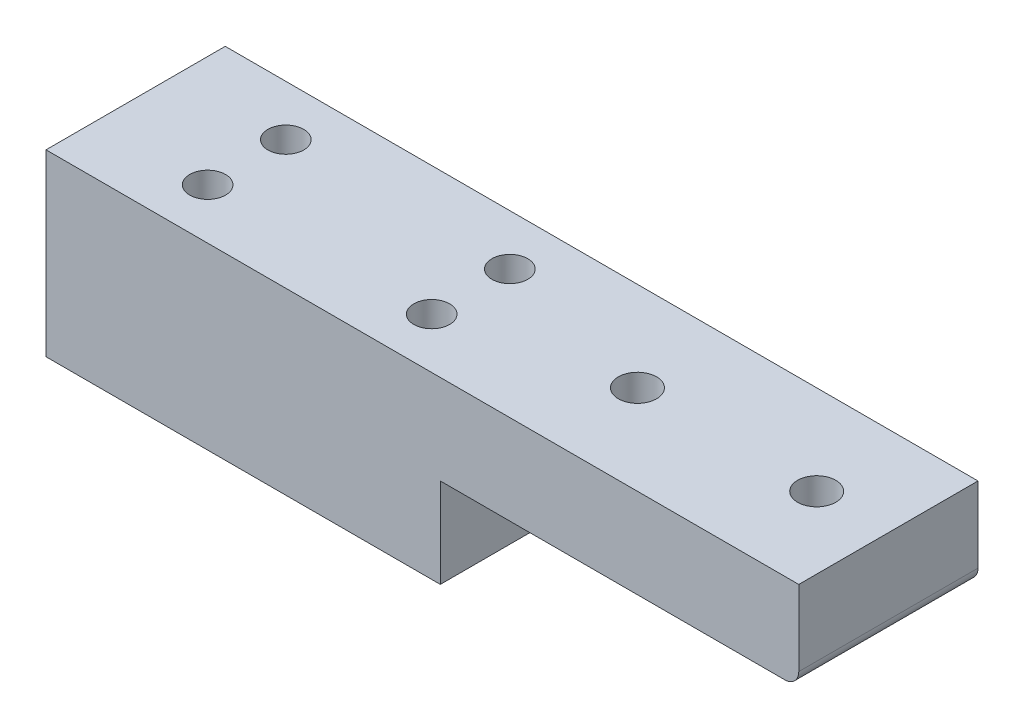
ISO-10303-21;
HEADER;
FILE_DESCRIPTION(('STEP AP214'),'2;1');
FILE_NAME('part.step','',(''),(''),'','','');
FILE_SCHEMA(('AUTOMOTIVE_DESIGN { 1 0 10303 214 1 1 1 1 }'));
ENDSEC;
DATA;
#1=APPLICATION_CONTEXT('core data for automotive mechanical design processes');
#2=APPLICATION_PROTOCOL_DEFINITION('international standard','automotive_design',2000,#1);
#3=PRODUCT_CONTEXT('',#1,'mechanical');
#4=PRODUCT('Part','Part','',(#3));
#5=PRODUCT_RELATED_PRODUCT_CATEGORY('part','',(#4));
#6=PRODUCT_DEFINITION_FORMATION('','',#4);
#7=PRODUCT_DEFINITION_CONTEXT('part definition',#1,'design');
#8=PRODUCT_DEFINITION('design','',#6,#7);
#9=PRODUCT_DEFINITION_SHAPE('','',#8);
#10=(LENGTH_UNIT() NAMED_UNIT(*) SI_UNIT(.MILLI.,.METRE.));
#11=(NAMED_UNIT(*) PLANE_ANGLE_UNIT() SI_UNIT($,.RADIAN.));
#12=(NAMED_UNIT(*) SI_UNIT($,.STERADIAN.) SOLID_ANGLE_UNIT());
#13=UNCERTAINTY_MEASURE_WITH_UNIT(LENGTH_MEASURE(1.E-05),#10,'distance_accuracy_value','');
#14=(GEOMETRIC_REPRESENTATION_CONTEXT(3) GLOBAL_UNCERTAINTY_ASSIGNED_CONTEXT((#13)) GLOBAL_UNIT_ASSIGNED_CONTEXT((#10,
#11,#12)) REPRESENTATION_CONTEXT('',''));
#15=CARTESIAN_POINT('',(0.,0.,0.));
#16=DIRECTION('',(0.,0.,1.));
#17=DIRECTION('',(1.,0.,0.));
#18=AXIS2_PLACEMENT_3D('',#15,#16,#17);
#19=CARTESIAN_POINT('',(0.,6.35,12.7));
#20=DIRECTION('',(0.,0.,-1.));
#21=DIRECTION('',(-1.,0.,0.));
#22=AXIS2_PLACEMENT_3D('',#19,#20,#21);
#23=PLANE('',#22);
#24=DIRECTION('',(1.,0.,0.));
#25=VECTOR('',#24,1.);
#26=CARTESIAN_POINT('',(0.,6.35,12.7));
#27=LINE('',#26,#25);
#28=CARTESIAN_POINT('',(25.4,6.35,12.7));
#29=VERTEX_POINT('',#28);
#30=CARTESIAN_POINT('',(49.8,6.35,12.7));
#31=VERTEX_POINT('',#30);
#32=EDGE_CURVE('E159',#29,#31,#27,.T.);
#33=ORIENTED_EDGE('',*,*,#32,.T.);
#34=CARTESIAN_POINT('',(49.8,7.35,12.7));
#35=DIRECTION('',(0.,0.,-1.));
#36=DIRECTION('',(-1.,0.,0.));
#37=AXIS2_PLACEMENT_3D('',#34,#35,#36);
#38=CIRCLE('',#37,1.);
#39=CARTESIAN_POINT('',(50.8,7.35,12.7));
#40=VERTEX_POINT('',#39);
#41=EDGE_CURVE('E11',#31,#40,#38,.F.);
#42=ORIENTED_EDGE('',*,*,#41,.T.);
#43=DIRECTION('',(0.,-1.,0.));
#44=VECTOR('',#43,1.);
#45=CARTESIAN_POINT('',(50.8,12.7,12.7));
#46=LINE('',#45,#44);
#47=CARTESIAN_POINT('',(50.8,12.7,12.7));
#48=VERTEX_POINT('',#47);
#49=EDGE_CURVE('E171',#48,#40,#46,.T.);
#50=ORIENTED_EDGE('',*,*,#49,.F.);
#51=DIRECTION('',(1.,0.,0.));
#52=VECTOR('',#51,1.);
#53=CARTESIAN_POINT('',(0.,12.7,12.7));
#54=LINE('',#53,#52);
#55=CARTESIAN_POINT('',(-2.54,12.7,12.7));
#56=VERTEX_POINT('',#55);
#57=EDGE_CURVE('E160',#56,#48,#54,.T.);
#58=ORIENTED_EDGE('',*,*,#57,.F.);
#59=DIRECTION('',(0.,1.,0.));
#60=VECTOR('',#59,1.);
#61=CARTESIAN_POINT('',(-2.54,12.7,12.7));
#62=LINE('',#61,#60);
#63=CARTESIAN_POINT('',(-2.54,0.,12.7));
#64=VERTEX_POINT('',#63);
#65=EDGE_CURVE('E106',#64,#56,#62,.T.);
#66=ORIENTED_EDGE('',*,*,#65,.F.);
#67=DIRECTION('',(1.,0.,0.));
#68=VECTOR('',#67,1.);
#69=CARTESIAN_POINT('',(0.,0.,12.7));
#70=LINE('',#69,#68);
#71=CARTESIAN_POINT('',(25.4,0.,12.7));
#72=VERTEX_POINT('',#71);
#73=EDGE_CURVE('E174',#64,#72,#70,.T.);
#74=ORIENTED_EDGE('',*,*,#73,.T.);
#75=DIRECTION('',(0.,-1.,0.));
#76=VECTOR('',#75,1.);
#77=CARTESIAN_POINT('',(25.4,6.35,12.7));
#78=LINE('',#77,#76);
#79=EDGE_CURVE('E186',#29,#72,#78,.T.);
#80=ORIENTED_EDGE('',*,*,#79,.F.);
#81=EDGE_LOOP('',(#33,#42,#50,#58,#66,#74,#80));
#82=FACE_BOUND('',#81,.T.);
#83=ADVANCED_FACE('F37',(#82),#23,.F.);
#84=CARTESIAN_POINT('',(25.4,6.35,0.));
#85=DIRECTION('',(-1.,0.,0.));
#86=DIRECTION('',(0.,0.,1.));
#87=AXIS2_PLACEMENT_3D('',#84,#85,#86);
#88=PLANE('',#87);
#89=DIRECTION('',(0.,0.,-1.));
#90=VECTOR('',#89,1.);
#91=CARTESIAN_POINT('',(25.4,0.,0.));
#92=LINE('',#91,#90);
#93=CARTESIAN_POINT('',(25.4,0.,0.));
#94=VERTEX_POINT('',#93);
#95=EDGE_CURVE('E181',#72,#94,#92,.T.);
#96=ORIENTED_EDGE('',*,*,#95,.T.);
#97=DIRECTION('',(0.,-1.,0.));
#98=VECTOR('',#97,1.);
#99=CARTESIAN_POINT('',(25.4,6.35,0.));
#100=LINE('',#99,#98);
#101=CARTESIAN_POINT('',(25.4,6.35,0.));
#102=VERTEX_POINT('',#101);
#103=EDGE_CURVE('E178',#102,#94,#100,.T.);
#104=ORIENTED_EDGE('',*,*,#103,.F.);
#105=DIRECTION('',(0.,0.,-1.));
#106=VECTOR('',#105,1.);
#107=CARTESIAN_POINT('',(25.4,6.35,0.));
#108=LINE('',#107,#106);
#109=EDGE_CURVE('E175',#29,#102,#108,.T.);
#110=ORIENTED_EDGE('',*,*,#109,.F.);
#111=ORIENTED_EDGE('',*,*,#79,.T.);
#112=EDGE_LOOP('',(#96,#104,#110,#111));
#113=FACE_BOUND('',#112,.T.);
#114=ADVANCED_FACE('F222',(#113),#88,.F.);
#115=CARTESIAN_POINT('',(0.,6.35,0.));
#116=DIRECTION('',(0.,0.,1.));
#117=DIRECTION('',(1.,0.,0.));
#118=AXIS2_PLACEMENT_3D('',#115,#116,#117);
#119=PLANE('',#118);
#120=DIRECTION('',(0.,-1.,0.));
#121=VECTOR('',#120,1.);
#122=CARTESIAN_POINT('',(50.8,12.7,0.));
#123=LINE('',#122,#121);
#124=CARTESIAN_POINT('',(50.8,12.7,0.));
#125=VERTEX_POINT('',#124);
#126=CARTESIAN_POINT('',(50.8,7.35,0.));
#127=VERTEX_POINT('',#126);
#128=EDGE_CURVE('E167',#125,#127,#123,.T.);
#129=ORIENTED_EDGE('',*,*,#128,.T.);
#130=CARTESIAN_POINT('',(49.8,7.35,0.));
#131=DIRECTION('',(0.,0.,1.));
#132=DIRECTION('',(1.,0.,0.));
#133=AXIS2_PLACEMENT_3D('',#130,#131,#132);
#134=CIRCLE('',#133,1.);
#135=CARTESIAN_POINT('',(49.8,6.35,0.));
#136=VERTEX_POINT('',#135);
#137=EDGE_CURVE('E59',#127,#136,#134,.F.);
#138=ORIENTED_EDGE('',*,*,#137,.T.);
#139=DIRECTION('',(-1.,0.,0.));
#140=VECTOR('',#139,1.);
#141=CARTESIAN_POINT('',(0.,6.35,0.));
#142=LINE('',#141,#140);
#143=EDGE_CURVE('E163',#136,#102,#142,.T.);
#144=ORIENTED_EDGE('',*,*,#143,.T.);
#145=ORIENTED_EDGE('',*,*,#103,.T.);
#146=DIRECTION('',(-1.,0.,0.));
#147=VECTOR('',#146,1.);
#148=CARTESIAN_POINT('',(0.,0.,0.));
#149=LINE('',#148,#147);
#150=CARTESIAN_POINT('',(-2.54,0.,0.));
#151=VERTEX_POINT('',#150);
#152=EDGE_CURVE('E179',#94,#151,#149,.T.);
#153=ORIENTED_EDGE('',*,*,#152,.T.);
#154=DIRECTION('',(0.,-1.,0.));
#155=VECTOR('',#154,1.);
#156=CARTESIAN_POINT('',(-2.54,12.7,0.));
#157=LINE('',#156,#155);
#158=CARTESIAN_POINT('',(-2.54,12.7,0.));
#159=VERTEX_POINT('',#158);
#160=EDGE_CURVE('E117',#159,#151,#157,.T.);
#161=ORIENTED_EDGE('',*,*,#160,.F.);
#162=DIRECTION('',(-1.,0.,0.));
#163=VECTOR('',#162,1.);
#164=CARTESIAN_POINT('',(0.,12.7,0.));
#165=LINE('',#164,#163);
#166=EDGE_CURVE('E165',#125,#159,#165,.T.);
#167=ORIENTED_EDGE('',*,*,#166,.F.);
#168=EDGE_LOOP('',(#129,#138,#144,#145,#153,#161,#167));
#169=FACE_BOUND('',#168,.T.);
#170=ADVANCED_FACE('F201',(#169),#119,.F.);
#171=CARTESIAN_POINT('',(0.,0.,0.));
#172=DIRECTION('',(0.,1.,0.));
#173=DIRECTION('',(0.,0.,1.));
#174=AXIS2_PLACEMENT_3D('',#171,#172,#173);
#175=PLANE('',#174);
#176=CARTESIAN_POINT('',(5.334,0.,3.5814));
#177=DIRECTION('',(0.,-1.,0.));
#178=DIRECTION('',(0.,0.,-1.));
#179=AXIS2_PLACEMENT_3D('',#176,#177,#178);
#180=CIRCLE('',#179,1.26999999999999);
#181=CARTESIAN_POINT('',(5.334,0.,2.31140000000001));
#182=VERTEX_POINT('',#181);
#183=EDGE_CURVE('E135',#182,#182,#180,.T.);
#184=ORIENTED_EDGE('',*,*,#183,.F.);
#185=EDGE_LOOP('',(#184));
#186=FACE_BOUND('',#185,.T.);
#187=CARTESIAN_POINT('',(21.209,0.,3.5814));
#188=DIRECTION('',(0.,-1.,0.));
#189=DIRECTION('',(0.,0.,-1.));
#190=AXIS2_PLACEMENT_3D('',#187,#188,#189);
#191=CIRCLE('',#190,1.26999999999999);
#192=CARTESIAN_POINT('',(21.209,0.,2.31140000000001));
#193=VERTEX_POINT('',#192);
#194=EDGE_CURVE('E141',#193,#193,#191,.T.);
#195=ORIENTED_EDGE('',*,*,#194,.F.);
#196=EDGE_LOOP('',(#195));
#197=FACE_BOUND('',#196,.T.);
#198=CARTESIAN_POINT('',(21.209,0.,9.1186));
#199=DIRECTION('',(0.,-1.,0.));
#200=DIRECTION('',(0.,0.,-1.));
#201=AXIS2_PLACEMENT_3D('',#198,#199,#200);
#202=CIRCLE('',#201,1.26999999999999);
#203=CARTESIAN_POINT('',(21.209,0.,7.84860000000001));
#204=VERTEX_POINT('',#203);
#205=EDGE_CURVE('E147',#204,#204,#202,.T.);
#206=ORIENTED_EDGE('',*,*,#205,.F.);
#207=EDGE_LOOP('',(#206));
#208=FACE_BOUND('',#207,.T.);
#209=CARTESIAN_POINT('',(5.334,0.,9.1186));
#210=DIRECTION('',(0.,-1.,0.));
#211=DIRECTION('',(0.,0.,-1.));
#212=AXIS2_PLACEMENT_3D('',#209,#210,#211);
#213=CIRCLE('',#212,1.26999999999999);
#214=CARTESIAN_POINT('',(5.334,0.,7.84860000000001));
#215=VERTEX_POINT('',#214);
#216=EDGE_CURVE('E153',#215,#215,#213,.T.);
#217=ORIENTED_EDGE('',*,*,#216,.F.);
#218=EDGE_LOOP('',(#217));
#219=FACE_BOUND('',#218,.T.);
#220=ORIENTED_EDGE('',*,*,#73,.F.);
#221=DIRECTION('',(0.,0.,1.));
#222=VECTOR('',#221,1.);
#223=CARTESIAN_POINT('',(-2.54,0.,12.7));
#224=LINE('',#223,#222);
#225=EDGE_CURVE('E120',#151,#64,#224,.T.);
#226=ORIENTED_EDGE('',*,*,#225,.F.);
#227=ORIENTED_EDGE('',*,*,#152,.F.);
#228=ORIENTED_EDGE('',*,*,#95,.F.);
#229=EDGE_LOOP('',(#220,#226,#227,#228));
#230=FACE_BOUND('',#229,.T.);
#231=ADVANCED_FACE('F231',(#186,#197,#208,#219,#230),#175,.F.);
#232=CARTESIAN_POINT('',(0.,6.35,0.));
#233=DIRECTION('',(0.,-1.,0.));
#234=DIRECTION('',(0.,0.,-1.));
#235=AXIS2_PLACEMENT_3D('',#232,#233,#234);
#236=PLANE('',#235);
#237=CARTESIAN_POINT('',(33.02,6.35,6.35));
#238=DIRECTION('',(0.,-1.,0.));
#239=DIRECTION('',(0.,0.,-1.));
#240=AXIS2_PLACEMENT_3D('',#237,#238,#239);
#241=CIRCLE('',#240,1.35255);
#242=CARTESIAN_POINT('',(33.02,6.35,4.99745));
#243=VERTEX_POINT('',#242);
#244=EDGE_CURVE('E123',#243,#243,#241,.T.);
#245=ORIENTED_EDGE('',*,*,#244,.F.);
#246=EDGE_LOOP('',(#245));
#247=FACE_BOUND('',#246,.T.);
#248=CARTESIAN_POINT('',(45.72,6.35,6.35));
#249=DIRECTION('',(0.,-1.,0.));
#250=DIRECTION('',(0.,0.,-1.));
#251=AXIS2_PLACEMENT_3D('',#248,#249,#250);
#252=CIRCLE('',#251,1.35255);
#253=CARTESIAN_POINT('',(45.72,6.35,4.99745));
#254=VERTEX_POINT('',#253);
#255=EDGE_CURVE('E129',#254,#254,#252,.T.);
#256=ORIENTED_EDGE('',*,*,#255,.F.);
#257=EDGE_LOOP('',(#256));
#258=FACE_BOUND('',#257,.T.);
#259=ORIENTED_EDGE('',*,*,#143,.F.);
#260=DIRECTION('',(0.,0.,-1.));
#261=VECTOR('',#260,1.);
#262=CARTESIAN_POINT('',(49.8,6.35,12.7));
#263=LINE('',#262,#261);
#264=EDGE_CURVE('E45',#136,#31,#263,.F.);
#265=ORIENTED_EDGE('',*,*,#264,.T.);
#266=ORIENTED_EDGE('',*,*,#32,.F.);
#267=ORIENTED_EDGE('',*,*,#109,.T.);
#268=EDGE_LOOP('',(#259,#265,#266,#267));
#269=FACE_BOUND('',#268,.T.);
#270=ADVANCED_FACE('F234',(#247,#258,#269),#236,.T.);
#271=CARTESIAN_POINT('',(0.,12.7,0.));
#272=DIRECTION('',(0.,-1.,0.));
#273=DIRECTION('',(0.,0.,-1.));
#274=AXIS2_PLACEMENT_3D('',#271,#272,#273);
#275=PLANE('',#274);
#276=CARTESIAN_POINT('',(33.02,12.7,6.35));
#277=DIRECTION('',(0.,-1.,0.));
#278=DIRECTION('',(0.,0.,-1.));
#279=AXIS2_PLACEMENT_3D('',#276,#277,#278);
#280=CIRCLE('',#279,1.35255);
#281=CARTESIAN_POINT('',(33.02,12.7,4.99745));
#282=VERTEX_POINT('',#281);
#283=EDGE_CURVE('E126',#282,#282,#280,.T.);
#284=ORIENTED_EDGE('',*,*,#283,.T.);
#285=EDGE_LOOP('',(#284));
#286=FACE_BOUND('',#285,.T.);
#287=CARTESIAN_POINT('',(45.72,12.7,6.35));
#288=DIRECTION('',(0.,-1.,0.));
#289=DIRECTION('',(0.,0.,-1.));
#290=AXIS2_PLACEMENT_3D('',#287,#288,#289);
#291=CIRCLE('',#290,1.35255);
#292=CARTESIAN_POINT('',(45.72,12.7,4.99745));
#293=VERTEX_POINT('',#292);
#294=EDGE_CURVE('E132',#293,#293,#291,.T.);
#295=ORIENTED_EDGE('',*,*,#294,.T.);
#296=EDGE_LOOP('',(#295));
#297=FACE_BOUND('',#296,.T.);
#298=CARTESIAN_POINT('',(5.334,12.7,3.5814));
#299=DIRECTION('',(0.,-1.,0.));
#300=DIRECTION('',(0.,0.,-1.));
#301=AXIS2_PLACEMENT_3D('',#298,#299,#300);
#302=CIRCLE('',#301,1.27);
#303=CARTESIAN_POINT('',(5.334,12.7,2.3114));
#304=VERTEX_POINT('',#303);
#305=EDGE_CURVE('E138',#304,#304,#302,.T.);
#306=ORIENTED_EDGE('',*,*,#305,.T.);
#307=EDGE_LOOP('',(#306));
#308=FACE_BOUND('',#307,.T.);
#309=CARTESIAN_POINT('',(21.209,12.7,3.5814));
#310=DIRECTION('',(0.,-1.,0.));
#311=DIRECTION('',(0.,0.,-1.));
#312=AXIS2_PLACEMENT_3D('',#309,#310,#311);
#313=CIRCLE('',#312,1.27);
#314=CARTESIAN_POINT('',(21.209,12.7,2.3114));
#315=VERTEX_POINT('',#314);
#316=EDGE_CURVE('E144',#315,#315,#313,.T.);
#317=ORIENTED_EDGE('',*,*,#316,.T.);
#318=EDGE_LOOP('',(#317));
#319=FACE_BOUND('',#318,.T.);
#320=CARTESIAN_POINT('',(21.209,12.7,9.1186));
#321=DIRECTION('',(0.,-1.,0.));
#322=DIRECTION('',(0.,0.,-1.));
#323=AXIS2_PLACEMENT_3D('',#320,#321,#322);
#324=CIRCLE('',#323,1.27);
#325=CARTESIAN_POINT('',(21.209,12.7,7.8486));
#326=VERTEX_POINT('',#325);
#327=EDGE_CURVE('E150',#326,#326,#324,.T.);
#328=ORIENTED_EDGE('',*,*,#327,.T.);
#329=EDGE_LOOP('',(#328));
#330=FACE_BOUND('',#329,.T.);
#331=CARTESIAN_POINT('',(5.334,12.7,9.1186));
#332=DIRECTION('',(0.,-1.,0.));
#333=DIRECTION('',(0.,0.,-1.));
#334=AXIS2_PLACEMENT_3D('',#331,#332,#333);
#335=CIRCLE('',#334,1.27);
#336=CARTESIAN_POINT('',(5.334,12.7,7.8486));
#337=VERTEX_POINT('',#336);
#338=EDGE_CURVE('E156',#337,#337,#335,.T.);
#339=ORIENTED_EDGE('',*,*,#338,.T.);
#340=EDGE_LOOP('',(#339));
#341=FACE_BOUND('',#340,.T.);
#342=ORIENTED_EDGE('',*,*,#166,.T.);
#343=DIRECTION('',(0.,0.,-1.));
#344=VECTOR('',#343,1.);
#345=CARTESIAN_POINT('',(-2.54,12.7,12.7));
#346=LINE('',#345,#344);
#347=EDGE_CURVE('E110',#56,#159,#346,.T.);
#348=ORIENTED_EDGE('',*,*,#347,.F.);
#349=ORIENTED_EDGE('',*,*,#57,.T.);
#350=DIRECTION('',(0.,0.,-1.));
#351=VECTOR('',#350,1.);
#352=CARTESIAN_POINT('',(50.8,12.7,12.7));
#353=LINE('',#352,#351);
#354=EDGE_CURVE('E162',#48,#125,#353,.T.);
#355=ORIENTED_EDGE('',*,*,#354,.T.);
#356=EDGE_LOOP('',(#342,#348,#349,#355));
#357=FACE_BOUND('',#356,.T.);
#358=ADVANCED_FACE('F205',(#286,#297,#308,#319,#330,#341,#357),#275,.F.);
#359=CARTESIAN_POINT('',(50.8,12.7,12.7));
#360=DIRECTION('',(-1.,0.,0.));
#361=DIRECTION('',(0.,0.,1.));
#362=AXIS2_PLACEMENT_3D('',#359,#360,#361);
#363=PLANE('',#362);
#364=ORIENTED_EDGE('',*,*,#49,.T.);
#365=DIRECTION('',(0.,0.,-1.));
#366=VECTOR('',#365,1.);
#367=CARTESIAN_POINT('',(50.8,7.35,0.));
#368=LINE('',#367,#366);
#369=EDGE_CURVE('E189',#40,#127,#368,.T.);
#370=ORIENTED_EDGE('',*,*,#369,.T.);
#371=ORIENTED_EDGE('',*,*,#128,.F.);
#372=ORIENTED_EDGE('',*,*,#354,.F.);
#373=EDGE_LOOP('',(#364,#370,#371,#372));
#374=FACE_BOUND('',#373,.T.);
#375=ADVANCED_FACE('F195',(#374),#363,.F.);
#376=CARTESIAN_POINT('',(5.334,0.,9.1186));
#377=DIRECTION('',(0.,-1.,0.));
#378=DIRECTION('',(0.,0.,-1.));
#379=AXIS2_PLACEMENT_3D('',#376,#377,#378);
#380=CYLINDRICAL_SURFACE('',#379,1.26999999999999);
#381=ORIENTED_EDGE('',*,*,#338,.F.);
#382=EDGE_LOOP('',(#381));
#383=FACE_BOUND('',#382,.T.);
#384=ORIENTED_EDGE('',*,*,#216,.T.);
#385=EDGE_LOOP('',(#384));
#386=FACE_BOUND('',#385,.T.);
#387=ADVANCED_FACE('F238',(#383,#386),#380,.F.);
#388=CARTESIAN_POINT('',(21.209,0.,9.1186));
#389=DIRECTION('',(0.,-1.,0.));
#390=DIRECTION('',(0.,0.,-1.));
#391=AXIS2_PLACEMENT_3D('',#388,#389,#390);
#392=CYLINDRICAL_SURFACE('',#391,1.26999999999999);
#393=ORIENTED_EDGE('',*,*,#327,.F.);
#394=EDGE_LOOP('',(#393));
#395=FACE_BOUND('',#394,.T.);
#396=ORIENTED_EDGE('',*,*,#205,.T.);
#397=EDGE_LOOP('',(#396));
#398=FACE_BOUND('',#397,.T.);
#399=ADVANCED_FACE('F247',(#395,#398),#392,.F.);
#400=CARTESIAN_POINT('',(21.209,0.,3.5814));
#401=DIRECTION('',(0.,-1.,0.));
#402=DIRECTION('',(0.,0.,-1.));
#403=AXIS2_PLACEMENT_3D('',#400,#401,#402);
#404=CYLINDRICAL_SURFACE('',#403,1.26999999999999);
#405=ORIENTED_EDGE('',*,*,#316,.F.);
#406=EDGE_LOOP('',(#405));
#407=FACE_BOUND('',#406,.T.);
#408=ORIENTED_EDGE('',*,*,#194,.T.);
#409=EDGE_LOOP('',(#408));
#410=FACE_BOUND('',#409,.T.);
#411=ADVANCED_FACE('F251',(#407,#410),#404,.F.);
#412=CARTESIAN_POINT('',(5.334,0.,3.5814));
#413=DIRECTION('',(0.,-1.,0.));
#414=DIRECTION('',(0.,0.,-1.));
#415=AXIS2_PLACEMENT_3D('',#412,#413,#414);
#416=CYLINDRICAL_SURFACE('',#415,1.26999999999999);
#417=ORIENTED_EDGE('',*,*,#305,.F.);
#418=EDGE_LOOP('',(#417));
#419=FACE_BOUND('',#418,.T.);
#420=ORIENTED_EDGE('',*,*,#183,.T.);
#421=EDGE_LOOP('',(#420));
#422=FACE_BOUND('',#421,.T.);
#423=ADVANCED_FACE('F255',(#419,#422),#416,.F.);
#424=CARTESIAN_POINT('',(45.72,6.35,6.35));
#425=DIRECTION('',(0.,-1.,0.));
#426=DIRECTION('',(0.,0.,-1.));
#427=AXIS2_PLACEMENT_3D('',#424,#425,#426);
#428=CYLINDRICAL_SURFACE('',#427,1.35255);
#429=ORIENTED_EDGE('',*,*,#294,.F.);
#430=EDGE_LOOP('',(#429));
#431=FACE_BOUND('',#430,.T.);
#432=ORIENTED_EDGE('',*,*,#255,.T.);
#433=EDGE_LOOP('',(#432));
#434=FACE_BOUND('',#433,.T.);
#435=ADVANCED_FACE('F218',(#431,#434),#428,.F.);
#436=CARTESIAN_POINT('',(33.02,6.35,6.35));
#437=DIRECTION('',(0.,-1.,0.));
#438=DIRECTION('',(0.,0.,-1.));
#439=AXIS2_PLACEMENT_3D('',#436,#437,#438);
#440=CYLINDRICAL_SURFACE('',#439,1.35255);
#441=ORIENTED_EDGE('',*,*,#283,.F.);
#442=EDGE_LOOP('',(#441));
#443=FACE_BOUND('',#442,.T.);
#444=ORIENTED_EDGE('',*,*,#244,.T.);
#445=EDGE_LOOP('',(#444));
#446=FACE_BOUND('',#445,.T.);
#447=ADVANCED_FACE('F211',(#443,#446),#440,.F.);
#448=CARTESIAN_POINT('',(49.8,7.35,12.7));
#449=DIRECTION('',(0.,0.,1.));
#450=DIRECTION('',(1.,0.,0.));
#451=AXIS2_PLACEMENT_3D('',#448,#449,#450);
#452=CYLINDRICAL_SURFACE('',#451,1.);
#453=ORIENTED_EDGE('',*,*,#41,.F.);
#454=ORIENTED_EDGE('',*,*,#264,.F.);
#455=ORIENTED_EDGE('',*,*,#137,.F.);
#456=ORIENTED_EDGE('',*,*,#369,.F.);
#457=EDGE_LOOP('',(#453,#454,#455,#456));
#458=FACE_BOUND('',#457,.T.);
#459=ADVANCED_FACE('F39',(#458),#452,.T.);
#460=CARTESIAN_POINT('',(-2.54,0.,0.));
#461=DIRECTION('',(1.,0.,0.));
#462=DIRECTION('',(0.,0.,-1.));
#463=AXIS2_PLACEMENT_3D('',#460,#461,#462);
#464=PLANE('',#463);
#465=CARTESIAN_POINT('',(-2.54,6.35,6.35));
#466=DIRECTION('',(-1.,0.,0.));
#467=DIRECTION('',(0.,0.,1.));
#468=AXIS2_PLACEMENT_3D('',#465,#466,#467);
#469=CIRCLE('',#468,1.35254999999999);
#470=CARTESIAN_POINT('',(-2.54,6.35,7.70254999999999));
#471=VERTEX_POINT('',#470);
#472=EDGE_CURVE('E107',#471,#471,#469,.T.);
#473=ORIENTED_EDGE('',*,*,#472,.F.);
#474=EDGE_LOOP('',(#473));
#475=FACE_BOUND('',#474,.T.);
#476=ORIENTED_EDGE('',*,*,#65,.T.);
#477=ORIENTED_EDGE('',*,*,#347,.T.);
#478=ORIENTED_EDGE('',*,*,#160,.T.);
#479=ORIENTED_EDGE('',*,*,#225,.T.);
#480=EDGE_LOOP('',(#476,#477,#478,#479));
#481=FACE_BOUND('',#480,.T.);
#482=ADVANCED_FACE('F100',(#475,#481),#464,.F.);
#483=CARTESIAN_POINT('',(2.9464,6.35,6.35));
#484=DIRECTION('',(-1.,0.,0.));
#485=DIRECTION('',(0.,0.,1.));
#486=AXIS2_PLACEMENT_3D('',#483,#484,#485);
#487=CONICAL_SURFACE('',#486,1.35255,1.02974425867665);
#488=CARTESIAN_POINT('',(3.75909403026573,6.35,6.35));
#489=VERTEX_POINT('',#488);
#490=VERTEX_LOOP('',#489);
#491=FACE_BOUND('',#490,.T.);
#492=CARTESIAN_POINT('',(2.9464,6.35,6.35));
#493=DIRECTION('',(-1.,0.,0.));
#494=DIRECTION('',(0.,0.,1.));
#495=AXIS2_PLACEMENT_3D('',#492,#493,#494);
#496=CIRCLE('',#495,1.35255);
#497=CARTESIAN_POINT('',(2.9464,6.35,7.70255));
#498=VERTEX_POINT('',#497);
#499=EDGE_CURVE('E104',#498,#498,#496,.T.);
#500=ORIENTED_EDGE('',*,*,#499,.T.);
#501=EDGE_LOOP('',(#500));
#502=FACE_BOUND('',#501,.T.);
#503=ADVANCED_FACE('F96',(#491,#502),#487,.F.);
#504=CARTESIAN_POINT('',(-2.54,6.35,6.35));
#505=DIRECTION('',(-1.,0.,0.));
#506=DIRECTION('',(0.,0.,1.));
#507=AXIS2_PLACEMENT_3D('',#504,#505,#506);
#508=CYLINDRICAL_SURFACE('',#507,1.35254999999999);
#509=ORIENTED_EDGE('',*,*,#499,.F.);
#510=EDGE_LOOP('',(#509));
#511=FACE_BOUND('',#510,.T.);
#512=ORIENTED_EDGE('',*,*,#472,.T.);
#513=EDGE_LOOP('',(#512));
#514=FACE_BOUND('',#513,.T.);
#515=ADVANCED_FACE('F99',(#511,#514),#508,.F.);
#516=CLOSED_SHELL('',(#83,#114,#170,#231,#270,#358,#375,#387,#399,#411,#423,#435,#447,#459,#482,
#503,#515));
#517=MANIFOLD_SOLID_BREP('B2',#516);
#518=ADVANCED_BREP_SHAPE_REPRESENTATION('',(#18,#517),#14);
#519=SHAPE_DEFINITION_REPRESENTATION(#9,#518);
ENDSEC;
END-ISO-10303-21;
